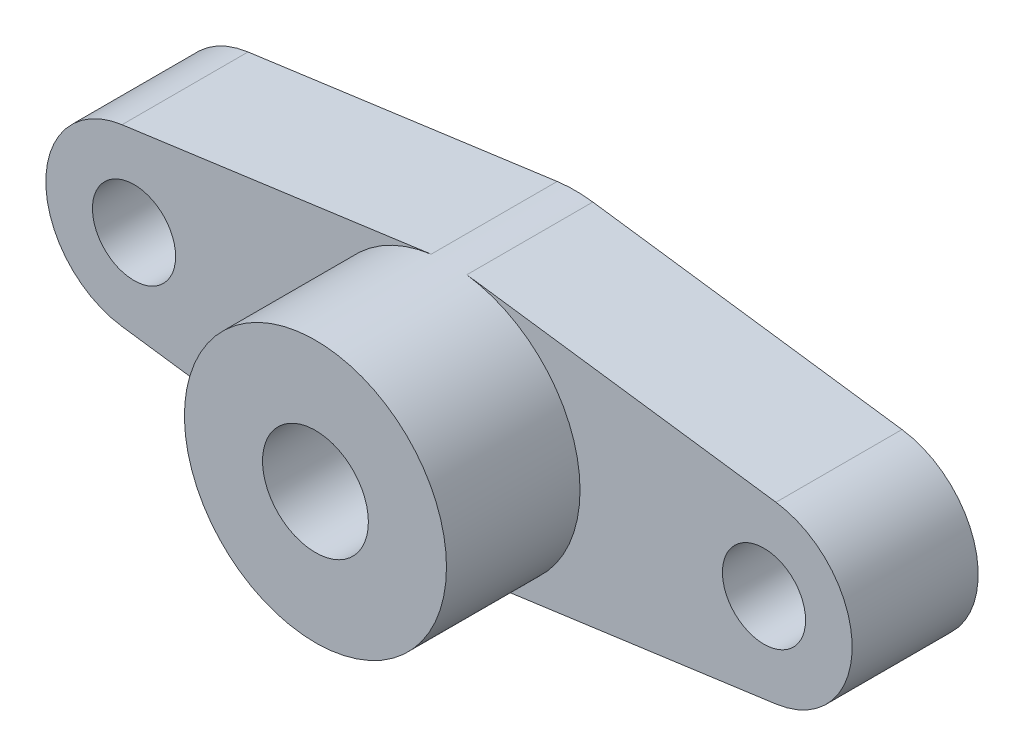
ISO-10303-21;
HEADER;
FILE_DESCRIPTION(('STEP AP214'),'2;1');
FILE_NAME('part.step','',(''),(''),'','','');
FILE_SCHEMA(('AUTOMOTIVE_DESIGN { 1 0 10303 214 1 1 1 1 }'));
ENDSEC;
DATA;
#1=APPLICATION_CONTEXT('core data for automotive mechanical design processes');
#2=APPLICATION_PROTOCOL_DEFINITION('international standard','automotive_design',2000,#1);
#3=PRODUCT_CONTEXT('',#1,'mechanical');
#4=PRODUCT('Part','Part','',(#3));
#5=PRODUCT_RELATED_PRODUCT_CATEGORY('part','',(#4));
#6=PRODUCT_DEFINITION_FORMATION('','',#4);
#7=PRODUCT_DEFINITION_CONTEXT('part definition',#1,'design');
#8=PRODUCT_DEFINITION('design','',#6,#7);
#9=PRODUCT_DEFINITION_SHAPE('','',#8);
#10=(LENGTH_UNIT() NAMED_UNIT(*) SI_UNIT(.MILLI.,.METRE.));
#11=(NAMED_UNIT(*) PLANE_ANGLE_UNIT() SI_UNIT($,.RADIAN.));
#12=(NAMED_UNIT(*) SI_UNIT($,.STERADIAN.) SOLID_ANGLE_UNIT());
#13=UNCERTAINTY_MEASURE_WITH_UNIT(LENGTH_MEASURE(1.E-05),#10,'distance_accuracy_value','');
#14=(GEOMETRIC_REPRESENTATION_CONTEXT(3) GLOBAL_UNCERTAINTY_ASSIGNED_CONTEXT((#13)) GLOBAL_UNIT_ASSIGNED_CONTEXT((#10,
#11,#12)) REPRESENTATION_CONTEXT('',''));
#15=CARTESIAN_POINT('',(0.,0.,0.));
#16=DIRECTION('',(0.,0.,1.));
#17=DIRECTION('',(1.,0.,0.));
#18=AXIS2_PLACEMENT_3D('',#15,#16,#17);
#19=CARTESIAN_POINT('',(0.,0.,0.));
#20=DIRECTION('',(0.,0.,-1.));
#21=DIRECTION('',(-1.,0.,0.));
#22=AXIS2_PLACEMENT_3D('',#19,#20,#21);
#23=PLANE('',#22);
#24=CARTESIAN_POINT('',(0.,0.,0.));
#25=DIRECTION('',(0.,0.,-1.));
#26=DIRECTION('',(-1.,0.,0.));
#27=AXIS2_PLACEMENT_3D('',#24,#25,#26);
#28=CIRCLE('',#27,2.1);
#29=CARTESIAN_POINT('',(-2.1,0.,0.));
#30=VERTEX_POINT('',#29);
#31=EDGE_CURVE('E273',#30,#30,#28,.T.);
#32=ORIENTED_EDGE('',*,*,#31,.F.);
#33=EDGE_LOOP('',(#32));
#34=FACE_BOUND('',#33,.T.);
#35=CARTESIAN_POINT('',(-12.5,0.,0.));
#36=DIRECTION('',(0.,0.,-1.));
#37=DIRECTION('',(-1.,0.,0.));
#38=AXIS2_PLACEMENT_3D('',#35,#36,#37);
#39=CIRCLE('',#38,1.65);
#40=CARTESIAN_POINT('',(-14.15,0.,0.));
#41=VERTEX_POINT('',#40);
#42=EDGE_CURVE('E132',#41,#41,#39,.T.);
#43=ORIENTED_EDGE('',*,*,#42,.F.);
#44=EDGE_LOOP('',(#43));
#45=FACE_BOUND('',#44,.T.);
#46=CARTESIAN_POINT('',(12.5,0.,0.));
#47=DIRECTION('',(0.,0.,-1.));
#48=DIRECTION('',(-1.,0.,0.));
#49=AXIS2_PLACEMENT_3D('',#46,#47,#48);
#50=CIRCLE('',#49,1.65);
#51=CARTESIAN_POINT('',(10.85,0.,0.));
#52=VERTEX_POINT('',#51);
#53=EDGE_CURVE('E216',#52,#52,#50,.T.);
#54=ORIENTED_EDGE('',*,*,#53,.F.);
#55=EDGE_LOOP('',(#54));
#56=FACE_BOUND('',#55,.T.);
#57=DIRECTION('',(-0.990708837146414,0.136,0.));
#58=VECTOR('',#57,1.);
#59=CARTESIAN_POINT('',(0.707199999999998,5.15168595316135,0.));
#60=LINE('',#59,#58);
#61=CARTESIAN_POINT('',(12.976,3.46748093001246,0.));
#62=VERTEX_POINT('',#61);
#63=CARTESIAN_POINT('',(0.707199999999998,5.15168595316135,0.));
#64=VERTEX_POINT('',#63);
#65=EDGE_CURVE('E204',#62,#64,#60,.T.);
#66=ORIENTED_EDGE('',*,*,#65,.F.);
#67=CARTESIAN_POINT('',(12.5,0.,0.));
#68=DIRECTION('',(0.,0.,-1.));
#69=DIRECTION('',(-1.,0.,0.));
#70=AXIS2_PLACEMENT_3D('',#67,#68,#69);
#71=CIRCLE('',#70,3.5);
#72=CARTESIAN_POINT('',(12.976,-3.46748093001244,0.));
#73=VERTEX_POINT('',#72);
#74=EDGE_CURVE('E228',#62,#73,#71,.T.);
#75=ORIENTED_EDGE('',*,*,#74,.T.);
#76=DIRECTION('',(-0.990708837146414,-0.136,0.));
#77=VECTOR('',#76,1.);
#78=CARTESIAN_POINT('',(0.707200000000002,-5.15168595316135,0.));
#79=LINE('',#78,#77);
#80=CARTESIAN_POINT('',(0.707200000000002,-5.15168595316135,0.));
#81=VERTEX_POINT('',#80);
#82=EDGE_CURVE('E12',#73,#81,#79,.T.);
#83=ORIENTED_EDGE('',*,*,#82,.T.);
#84=CARTESIAN_POINT('',(0.,0.,0.));
#85=DIRECTION('',(0.,0.,-1.));
#86=DIRECTION('',(-1.,0.,0.));
#87=AXIS2_PLACEMENT_3D('',#84,#85,#86);
#88=CIRCLE('',#87,5.2);
#89=CARTESIAN_POINT('',(-0.7072,-5.15168595316135,0.));
#90=VERTEX_POINT('',#89);
#91=EDGE_CURVE('E240',#81,#90,#88,.T.);
#92=ORIENTED_EDGE('',*,*,#91,.T.);
#93=DIRECTION('',(-0.990708837146414,0.136,0.));
#94=VECTOR('',#93,1.);
#95=CARTESIAN_POINT('',(-0.7072,-5.15168595316135,0.));
#96=LINE('',#95,#94);
#97=CARTESIAN_POINT('',(-12.976,-3.46748093001245,0.));
#98=VERTEX_POINT('',#97);
#99=EDGE_CURVE('E254',#90,#98,#96,.T.);
#100=ORIENTED_EDGE('',*,*,#99,.T.);
#101=CARTESIAN_POINT('',(-12.5,0.,0.));
#102=DIRECTION('',(0.,0.,-1.));
#103=DIRECTION('',(-1.,0.,0.));
#104=AXIS2_PLACEMENT_3D('',#101,#102,#103);
#105=CIRCLE('',#104,3.5);
#106=CARTESIAN_POINT('',(-12.976,3.46748093001245,0.));
#107=VERTEX_POINT('',#106);
#108=EDGE_CURVE('E235',#98,#107,#105,.T.);
#109=ORIENTED_EDGE('',*,*,#108,.T.);
#110=DIRECTION('',(0.990708837146414,0.136,0.));
#111=VECTOR('',#110,1.);
#112=CARTESIAN_POINT('',(-0.7072,5.15168595316135,0.));
#113=LINE('',#112,#111);
#114=CARTESIAN_POINT('',(-0.7072,5.15168595316135,0.));
#115=VERTEX_POINT('',#114);
#116=EDGE_CURVE('E137',#107,#115,#113,.T.);
#117=ORIENTED_EDGE('',*,*,#116,.T.);
#118=CARTESIAN_POINT('',(0.,0.,0.));
#119=DIRECTION('',(0.,0.,-1.));
#120=DIRECTION('',(-1.,0.,0.));
#121=AXIS2_PLACEMENT_3D('',#118,#119,#120);
#122=CIRCLE('',#121,5.2);
#123=EDGE_CURVE('E232',#64,#115,#122,.F.);
#124=ORIENTED_EDGE('',*,*,#123,.F.);
#125=EDGE_LOOP('',(#66,#75,#83,#92,#100,#109,#117,#124));
#126=FACE_BOUND('',#125,.T.);
#127=ADVANCED_FACE('F129',(#34,#45,#56,#126),#23,.T.);
#128=CARTESIAN_POINT('',(0.,0.,5.));
#129=DIRECTION('',(0.,0.,-1.));
#130=DIRECTION('',(-1.,0.,0.));
#131=AXIS2_PLACEMENT_3D('',#128,#129,#130);
#132=PLANE('',#131);
#133=CARTESIAN_POINT('',(12.5,0.,5.));
#134=DIRECTION('',(0.,0.,1.));
#135=DIRECTION('',(1.,0.,0.));
#136=AXIS2_PLACEMENT_3D('',#133,#134,#135);
#137=CIRCLE('',#136,1.65);
#138=CARTESIAN_POINT('',(14.15,0.,5.));
#139=VERTEX_POINT('',#138);
#140=EDGE_CURVE('E267',#139,#139,#137,.T.);
#141=ORIENTED_EDGE('',*,*,#140,.F.);
#142=EDGE_LOOP('',(#141));
#143=FACE_BOUND('',#142,.T.);
#144=CARTESIAN_POINT('',(12.5,0.,5.));
#145=DIRECTION('',(0.,0.,1.));
#146=DIRECTION('',(1.,0.,0.));
#147=AXIS2_PLACEMENT_3D('',#144,#145,#146);
#148=CIRCLE('',#147,3.5);
#149=CARTESIAN_POINT('',(12.976,-3.46748093001244,5.));
#150=VERTEX_POINT('',#149);
#151=CARTESIAN_POINT('',(12.976,3.46748093001246,5.));
#152=VERTEX_POINT('',#151);
#153=EDGE_CURVE('E214',#150,#152,#148,.T.);
#154=ORIENTED_EDGE('',*,*,#153,.T.);
#155=DIRECTION('',(0.990708837146414,-0.136,0.));
#156=VECTOR('',#155,1.);
#157=CARTESIAN_POINT('',(0.707199999999998,5.15168595316135,5.));
#158=LINE('',#157,#156);
#159=CARTESIAN_POINT('',(0.707199999999998,5.15168595316135,5.));
#160=VERTEX_POINT('',#159);
#161=EDGE_CURVE('E202',#160,#152,#158,.T.);
#162=ORIENTED_EDGE('',*,*,#161,.F.);
#163=CARTESIAN_POINT('',(0.,0.,5.));
#164=DIRECTION('',(0.,0.,1.));
#165=DIRECTION('',(1.,0.,0.));
#166=AXIS2_PLACEMENT_3D('',#163,#164,#165);
#167=CIRCLE('',#166,5.2);
#168=CARTESIAN_POINT('',(0.707200000000002,-5.15168595316135,5.));
#169=VERTEX_POINT('',#168);
#170=EDGE_CURVE('E212',#169,#160,#167,.T.);
#171=ORIENTED_EDGE('',*,*,#170,.F.);
#172=DIRECTION('',(0.990708837146414,0.136,0.));
#173=VECTOR('',#172,1.);
#174=CARTESIAN_POINT('',(0.707200000000002,-5.15168595316135,5.));
#175=LINE('',#174,#173);
#176=EDGE_CURVE('E145',#169,#150,#175,.T.);
#177=ORIENTED_EDGE('',*,*,#176,.T.);
#178=EDGE_LOOP('',(#154,#162,#171,#177));
#179=FACE_BOUND('',#178,.T.);
#180=ADVANCED_FACE('F211',(#143,#179),#132,.F.);
#181=CARTESIAN_POINT('',(-12.5,0.,5.));
#182=DIRECTION('',(0.,0.,1.));
#183=DIRECTION('',(1.,0.,0.));
#184=AXIS2_PLACEMENT_3D('',#181,#182,#183);
#185=CIRCLE('',#184,1.65);
#186=CARTESIAN_POINT('',(-10.85,0.,5.));
#187=VERTEX_POINT('',#186);
#188=EDGE_CURVE('E270',#187,#187,#185,.T.);
#189=ORIENTED_EDGE('',*,*,#188,.F.);
#190=EDGE_LOOP('',(#189));
#191=FACE_BOUND('',#190,.T.);
#192=CARTESIAN_POINT('',(-12.5,0.,5.));
#193=DIRECTION('',(0.,0.,1.));
#194=DIRECTION('',(1.,0.,0.));
#195=AXIS2_PLACEMENT_3D('',#192,#193,#194);
#196=CIRCLE('',#195,3.5);
#197=CARTESIAN_POINT('',(-12.976,3.46748093001245,5.));
#198=VERTEX_POINT('',#197);
#199=CARTESIAN_POINT('',(-12.976,-3.46748093001245,5.));
#200=VERTEX_POINT('',#199);
#201=EDGE_CURVE('E247',#198,#200,#196,.T.);
#202=ORIENTED_EDGE('',*,*,#201,.T.);
#203=DIRECTION('',(0.990708837146414,-0.136,0.));
#204=VECTOR('',#203,1.);
#205=CARTESIAN_POINT('',(-0.7072,-5.15168595316135,5.));
#206=LINE('',#205,#204);
#207=CARTESIAN_POINT('',(-0.7072,-5.15168595316135,5.));
#208=VERTEX_POINT('',#207);
#209=EDGE_CURVE('E260',#200,#208,#206,.T.);
#210=ORIENTED_EDGE('',*,*,#209,.T.);
#211=CARTESIAN_POINT('',(-0.7072,5.15168595316135,5.));
#212=VERTEX_POINT('',#211);
#213=EDGE_CURVE('E222',#212,#208,#167,.T.);
#214=ORIENTED_EDGE('',*,*,#213,.F.);
#215=DIRECTION('',(-0.990708837146414,-0.136,0.));
#216=VECTOR('',#215,1.);
#217=CARTESIAN_POINT('',(-0.7072,5.15168595316135,5.));
#218=LINE('',#217,#216);
#219=EDGE_CURVE('E153',#212,#198,#218,.T.);
#220=ORIENTED_EDGE('',*,*,#219,.T.);
#221=EDGE_LOOP('',(#202,#210,#214,#220));
#222=FACE_BOUND('',#221,.T.);
#223=ADVANCED_FACE('F290',(#191,#222),#132,.F.);
#224=CARTESIAN_POINT('',(0.,0.,10.3));
#225=DIRECTION('',(0.,0.,-1.));
#226=DIRECTION('',(-1.,0.,0.));
#227=AXIS2_PLACEMENT_3D('',#224,#225,#226);
#228=CYLINDRICAL_SURFACE('',#227,5.2);
#229=CARTESIAN_POINT('',(0.,0.,10.3));
#230=DIRECTION('',(0.,0.,1.));
#231=DIRECTION('',(1.,0.,0.));
#232=AXIS2_PLACEMENT_3D('',#229,#230,#231);
#233=CIRCLE('',#232,5.2);
#234=CARTESIAN_POINT('',(5.2,0.,10.3));
#235=VERTEX_POINT('',#234);
#236=EDGE_CURVE('E220',#235,#235,#233,.T.);
#237=ORIENTED_EDGE('',*,*,#236,.F.);
#238=EDGE_LOOP('',(#237));
#239=FACE_BOUND('',#238,.T.);
#240=ORIENTED_EDGE('',*,*,#170,.T.);
#241=DIRECTION('',(0.,0.,1.));
#242=VECTOR('',#241,1.);
#243=CARTESIAN_POINT('',(0.707199999999998,5.15168595316135,-0.3));
#244=LINE('',#243,#242);
#245=EDGE_CURVE('E198',#64,#160,#244,.T.);
#246=ORIENTED_EDGE('',*,*,#245,.F.);
#247=ORIENTED_EDGE('',*,*,#123,.T.);
#248=DIRECTION('',(0.,0.,1.));
#249=VECTOR('',#248,1.);
#250=CARTESIAN_POINT('',(-0.7072,5.15168595316135,-0.3));
#251=LINE('',#250,#249);
#252=EDGE_CURVE('E242',#115,#212,#251,.T.);
#253=ORIENTED_EDGE('',*,*,#252,.T.);
#254=ORIENTED_EDGE('',*,*,#213,.T.);
#255=DIRECTION('',(0.,0.,1.));
#256=VECTOR('',#255,1.);
#257=CARTESIAN_POINT('',(-0.7072,-5.15168595316135,-0.3));
#258=LINE('',#257,#256);
#259=EDGE_CURVE('E258',#90,#208,#258,.T.);
#260=ORIENTED_EDGE('',*,*,#259,.F.);
#261=ORIENTED_EDGE('',*,*,#91,.F.);
#262=DIRECTION('',(0.,0.,1.));
#263=VECTOR('',#262,1.);
#264=CARTESIAN_POINT('',(0.707200000000002,-5.15168595316135,-0.3));
#265=LINE('',#264,#263);
#266=EDGE_CURVE('E219',#81,#169,#265,.T.);
#267=ORIENTED_EDGE('',*,*,#266,.T.);
#268=EDGE_LOOP('',(#240,#246,#247,#253,#254,#260,#261,#267));
#269=FACE_BOUND('',#268,.T.);
#270=ADVANCED_FACE('F218',(#239,#269),#228,.T.);
#271=CARTESIAN_POINT('',(0.,0.,10.3));
#272=DIRECTION('',(0.,0.,1.));
#273=DIRECTION('',(1.,0.,0.));
#274=AXIS2_PLACEMENT_3D('',#271,#272,#273);
#275=PLANE('',#274);
#276=CARTESIAN_POINT('',(0.,0.,10.3));
#277=DIRECTION('',(0.,0.,1.));
#278=DIRECTION('',(1.,0.,0.));
#279=AXIS2_PLACEMENT_3D('',#276,#277,#278);
#280=CIRCLE('',#279,2.1);
#281=CARTESIAN_POINT('',(2.1,0.,10.3));
#282=VERTEX_POINT('',#281);
#283=EDGE_CURVE('E276',#282,#282,#280,.T.);
#284=ORIENTED_EDGE('',*,*,#283,.F.);
#285=EDGE_LOOP('',(#284));
#286=FACE_BOUND('',#285,.T.);
#287=ORIENTED_EDGE('',*,*,#236,.T.);
#288=EDGE_LOOP('',(#287));
#289=FACE_BOUND('',#288,.T.);
#290=ADVANCED_FACE('F282',(#286,#289),#275,.T.);
#291=CARTESIAN_POINT('',(-12.5,0.,-0.3));
#292=DIRECTION('',(0.,0.,1.));
#293=DIRECTION('',(1.,0.,0.));
#294=AXIS2_PLACEMENT_3D('',#291,#292,#293);
#295=CYLINDRICAL_SURFACE('',#294,3.5);
#296=ORIENTED_EDGE('',*,*,#108,.F.);
#297=DIRECTION('',(0.,0.,1.));
#298=VECTOR('',#297,1.);
#299=CARTESIAN_POINT('',(-12.976,-3.46748093001245,-0.3));
#300=LINE('',#299,#298);
#301=EDGE_CURVE('E257',#98,#200,#300,.T.);
#302=ORIENTED_EDGE('',*,*,#301,.T.);
#303=ORIENTED_EDGE('',*,*,#201,.F.);
#304=DIRECTION('',(0.,0.,1.));
#305=VECTOR('',#304,1.);
#306=CARTESIAN_POINT('',(-12.976,3.46748093001245,-0.3));
#307=LINE('',#306,#305);
#308=EDGE_CURVE('E243',#107,#198,#307,.T.);
#309=ORIENTED_EDGE('',*,*,#308,.F.);
#310=EDGE_LOOP('',(#296,#302,#303,#309));
#311=FACE_BOUND('',#310,.T.);
#312=ADVANCED_FACE('F285',(#311),#295,.T.);
#313=CARTESIAN_POINT('',(-0.7072,5.15168595316135,-0.3));
#314=DIRECTION('',(-0.136,0.990708837146414,0.));
#315=DIRECTION('',(-0.990708837146414,-0.136,0.));
#316=AXIS2_PLACEMENT_3D('',#313,#314,#315);
#317=PLANE('',#316);
#318=ORIENTED_EDGE('',*,*,#308,.T.);
#319=ORIENTED_EDGE('',*,*,#219,.F.);
#320=ORIENTED_EDGE('',*,*,#252,.F.);
#321=ORIENTED_EDGE('',*,*,#116,.F.);
#322=EDGE_LOOP('',(#318,#319,#320,#321));
#323=FACE_BOUND('',#322,.T.);
#324=ADVANCED_FACE('F309',(#323),#317,.T.);
#325=CARTESIAN_POINT('',(12.5,0.,-0.3));
#326=DIRECTION('',(0.,0.,1.));
#327=DIRECTION('',(1.,0.,0.));
#328=AXIS2_PLACEMENT_3D('',#325,#326,#327);
#329=CYLINDRICAL_SURFACE('',#328,3.5);
#330=ORIENTED_EDGE('',*,*,#74,.F.);
#331=DIRECTION('',(0.,0.,1.));
#332=VECTOR('',#331,1.);
#333=CARTESIAN_POINT('',(12.976,3.46748093001246,-0.3));
#334=LINE('',#333,#332);
#335=EDGE_CURVE('E207',#62,#152,#334,.T.);
#336=ORIENTED_EDGE('',*,*,#335,.T.);
#337=ORIENTED_EDGE('',*,*,#153,.F.);
#338=DIRECTION('',(0.,0.,1.));
#339=VECTOR('',#338,1.);
#340=CARTESIAN_POINT('',(12.976,-3.46748093001244,-0.3));
#341=LINE('',#340,#339);
#342=EDGE_CURVE('E249',#73,#150,#341,.T.);
#343=ORIENTED_EDGE('',*,*,#342,.F.);
#344=EDGE_LOOP('',(#330,#336,#337,#343));
#345=FACE_BOUND('',#344,.T.);
#346=ADVANCED_FACE('F321',(#345),#329,.T.);
#347=CARTESIAN_POINT('',(0.707200000000002,-5.15168595316135,-0.3));
#348=DIRECTION('',(0.136,-0.990708837146414,0.));
#349=DIRECTION('',(0.990708837146414,0.136,0.));
#350=AXIS2_PLACEMENT_3D('',#347,#348,#349);
#351=PLANE('',#350);
#352=ORIENTED_EDGE('',*,*,#342,.T.);
#353=ORIENTED_EDGE('',*,*,#176,.F.);
#354=ORIENTED_EDGE('',*,*,#266,.F.);
#355=ORIENTED_EDGE('',*,*,#82,.F.);
#356=EDGE_LOOP('',(#352,#353,#354,#355));
#357=FACE_BOUND('',#356,.T.);
#358=ADVANCED_FACE('F318',(#357),#351,.T.);
#359=CARTESIAN_POINT('',(-0.7072,-5.15168595316135,-0.3));
#360=DIRECTION('',(-0.136,-0.990708837146414,0.));
#361=DIRECTION('',(0.990708837146414,-0.136,0.));
#362=AXIS2_PLACEMENT_3D('',#359,#360,#361);
#363=PLANE('',#362);
#364=ORIENTED_EDGE('',*,*,#259,.T.);
#365=ORIENTED_EDGE('',*,*,#209,.F.);
#366=ORIENTED_EDGE('',*,*,#301,.F.);
#367=ORIENTED_EDGE('',*,*,#99,.F.);
#368=EDGE_LOOP('',(#364,#365,#366,#367));
#369=FACE_BOUND('',#368,.T.);
#370=ADVANCED_FACE('F316',(#369),#363,.T.);
#371=CARTESIAN_POINT('',(0.707199999999998,5.15168595316135,-0.3));
#372=DIRECTION('',(-0.136,-0.990708837146414,0.));
#373=DIRECTION('',(0.990708837146414,-0.136,0.));
#374=AXIS2_PLACEMENT_3D('',#371,#372,#373);
#375=PLANE('',#374);
#376=ORIENTED_EDGE('',*,*,#65,.T.);
#377=ORIENTED_EDGE('',*,*,#245,.T.);
#378=ORIENTED_EDGE('',*,*,#161,.T.);
#379=ORIENTED_EDGE('',*,*,#335,.F.);
#380=EDGE_LOOP('',(#376,#377,#378,#379));
#381=FACE_BOUND('',#380,.T.);
#382=ADVANCED_FACE('F200',(#381),#375,.F.);
#383=CARTESIAN_POINT('',(12.5,0.,5.));
#384=DIRECTION('',(0.,0.,1.));
#385=DIRECTION('',(1.,0.,0.));
#386=AXIS2_PLACEMENT_3D('',#383,#384,#385);
#387=CYLINDRICAL_SURFACE('',#386,1.65);
#388=ORIENTED_EDGE('',*,*,#53,.T.);
#389=EDGE_LOOP('',(#388));
#390=FACE_BOUND('',#389,.T.);
#391=ORIENTED_EDGE('',*,*,#140,.T.);
#392=EDGE_LOOP('',(#391));
#393=FACE_BOUND('',#392,.T.);
#394=ADVANCED_FACE('F368',(#390,#393),#387,.F.);
#395=CARTESIAN_POINT('',(-12.5,0.,5.));
#396=DIRECTION('',(0.,0.,1.));
#397=DIRECTION('',(1.,0.,0.));
#398=AXIS2_PLACEMENT_3D('',#395,#396,#397);
#399=CYLINDRICAL_SURFACE('',#398,1.65);
#400=ORIENTED_EDGE('',*,*,#42,.T.);
#401=EDGE_LOOP('',(#400));
#402=FACE_BOUND('',#401,.T.);
#403=ORIENTED_EDGE('',*,*,#188,.T.);
#404=EDGE_LOOP('',(#403));
#405=FACE_BOUND('',#404,.T.);
#406=ADVANCED_FACE('F392',(#402,#405),#399,.F.);
#407=CARTESIAN_POINT('',(0.,0.,10.3));
#408=DIRECTION('',(0.,0.,1.));
#409=DIRECTION('',(1.,0.,0.));
#410=AXIS2_PLACEMENT_3D('',#407,#408,#409);
#411=CYLINDRICAL_SURFACE('',#410,2.1);
#412=ORIENTED_EDGE('',*,*,#31,.T.);
#413=EDGE_LOOP('',(#412));
#414=FACE_BOUND('',#413,.T.);
#415=ORIENTED_EDGE('',*,*,#283,.T.);
#416=EDGE_LOOP('',(#415));
#417=FACE_BOUND('',#416,.T.);
#418=ADVANCED_FACE('F280',(#414,#417),#411,.F.);
#419=CLOSED_SHELL('',(#127,#180,#223,#270,#290,#312,#324,#346,#358,#370,#382,#394,#406,#418));
#420=MANIFOLD_SOLID_BREP('B2',#419);
#421=ADVANCED_BREP_SHAPE_REPRESENTATION('',(#18,#420),#14);
#422=SHAPE_DEFINITION_REPRESENTATION(#9,#421);
ENDSEC;
END-ISO-10303-21;
